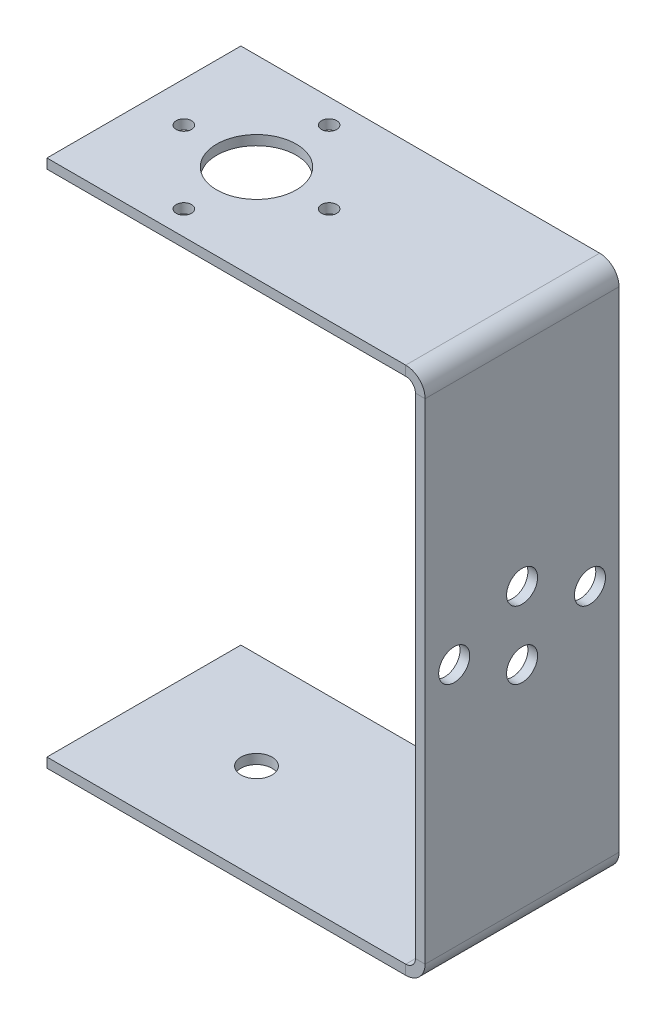
ISO-10303-21;
HEADER;
FILE_DESCRIPTION(('STEP AP214'),'2;1');
FILE_NAME('part.step','',(''),(''),'','','');
FILE_SCHEMA(('AUTOMOTIVE_DESIGN { 1 0 10303 214 1 1 1 1 }'));
ENDSEC;
DATA;
#1=APPLICATION_CONTEXT('core data for automotive mechanical design processes');
#2=APPLICATION_PROTOCOL_DEFINITION('international standard','automotive_design',2000,#1);
#3=PRODUCT_CONTEXT('',#1,'mechanical');
#4=PRODUCT('Part','Part','',(#3));
#5=PRODUCT_RELATED_PRODUCT_CATEGORY('part','',(#4));
#6=PRODUCT_DEFINITION_FORMATION('','',#4);
#7=PRODUCT_DEFINITION_CONTEXT('part definition',#1,'design');
#8=PRODUCT_DEFINITION('design','',#6,#7);
#9=PRODUCT_DEFINITION_SHAPE('','',#8);
#10=(LENGTH_UNIT() NAMED_UNIT(*) SI_UNIT(.MILLI.,.METRE.));
#11=(NAMED_UNIT(*) PLANE_ANGLE_UNIT() SI_UNIT($,.RADIAN.));
#12=(NAMED_UNIT(*) SI_UNIT($,.STERADIAN.) SOLID_ANGLE_UNIT());
#13=UNCERTAINTY_MEASURE_WITH_UNIT(LENGTH_MEASURE(1.E-05),#10,'distance_accuracy_value','');
#14=(GEOMETRIC_REPRESENTATION_CONTEXT(3) GLOBAL_UNCERTAINTY_ASSIGNED_CONTEXT((#13)) GLOBAL_UNIT_ASSIGNED_CONTEXT((#10,
#11,#12)) REPRESENTATION_CONTEXT('',''));
#15=CARTESIAN_POINT('',(0.,0.,0.));
#16=DIRECTION('',(0.,0.,1.));
#17=DIRECTION('',(1.,0.,0.));
#18=AXIS2_PLACEMENT_3D('',#15,#16,#17);
#19=CARTESIAN_POINT('',(-26.39,1.,-10.));
#20=DIRECTION('',(0.,-1.,0.));
#21=DIRECTION('',(0.,0.,-1.));
#22=AXIS2_PLACEMENT_3D('',#19,#20,#21);
#23=CYLINDRICAL_SURFACE('',#22,1.6);
#24=CARTESIAN_POINT('',(-26.39,1.,-10.));
#25=DIRECTION('',(0.,-1.,0.));
#26=DIRECTION('',(0.,0.,-1.));
#27=AXIS2_PLACEMENT_3D('',#24,#25,#26);
#28=CIRCLE('',#27,1.6);
#29=CARTESIAN_POINT('',(-26.39,1.,-11.6));
#30=VERTEX_POINT('',#29);
#31=EDGE_CURVE('E259',#30,#30,#28,.T.);
#32=ORIENTED_EDGE('',*,*,#31,.F.);
#33=EDGE_LOOP('',(#32));
#34=FACE_BOUND('',#33,.T.);
#35=CARTESIAN_POINT('',(-26.39,0.,-10.));
#36=DIRECTION('',(0.,-1.,0.));
#37=DIRECTION('',(0.,0.,-1.));
#38=AXIS2_PLACEMENT_3D('',#35,#36,#37);
#39=CIRCLE('',#38,1.6);
#40=CARTESIAN_POINT('',(-26.39,0.,-11.6));
#41=VERTEX_POINT('',#40);
#42=EDGE_CURVE('E187',#41,#41,#39,.T.);
#43=ORIENTED_EDGE('',*,*,#42,.T.);
#44=EDGE_LOOP('',(#43));
#45=FACE_BOUND('',#44,.T.);
#46=ADVANCED_FACE('F35',(#34,#45),#23,.F.);
#47=CARTESIAN_POINT('',(-38.,84.1189633792524,0.));
#48=DIRECTION('',(-1.,0.,0.));
#49=DIRECTION('',(0.,0.,-1.));
#50=AXIS2_PLACEMENT_3D('',#47,#48,#49);
#51=PLANE('',#50);
#52=DIRECTION('',(0.,0.,1.));
#53=VECTOR('',#52,1.);
#54=CARTESIAN_POINT('',(-38.,0.,0.));
#55=LINE('',#54,#53);
#56=CARTESIAN_POINT('',(-38.,0.,-20.));
#57=VERTEX_POINT('',#56);
#58=CARTESIAN_POINT('',(-38.,0.,0.));
#59=VERTEX_POINT('',#58);
#60=EDGE_CURVE('E69',#57,#59,#55,.T.);
#61=ORIENTED_EDGE('',*,*,#60,.T.);
#62=DIRECTION('',(0.,-1.,0.));
#63=VECTOR('',#62,1.);
#64=CARTESIAN_POINT('',(-38.,84.1189633792524,0.));
#65=LINE('',#64,#63);
#66=CARTESIAN_POINT('',(-38.,0.999999999999997,0.));
#67=VERTEX_POINT('',#66);
#68=EDGE_CURVE('E161',#67,#59,#65,.T.);
#69=ORIENTED_EDGE('',*,*,#68,.F.);
#70=DIRECTION('',(0.,0.,-1.));
#71=VECTOR('',#70,1.);
#72=CARTESIAN_POINT('',(-38.,1.,0.));
#73=LINE('',#72,#71);
#74=CARTESIAN_POINT('',(-38.,0.999999999999997,-20.));
#75=VERTEX_POINT('',#74);
#76=EDGE_CURVE('E54',#67,#75,#73,.T.);
#77=ORIENTED_EDGE('',*,*,#76,.T.);
#78=DIRECTION('',(0.,-1.,0.));
#79=VECTOR('',#78,1.);
#80=CARTESIAN_POINT('',(-38.,84.1189633792524,-20.));
#81=LINE('',#80,#79);
#82=EDGE_CURVE('E177',#75,#57,#81,.T.);
#83=ORIENTED_EDGE('',*,*,#82,.T.);
#84=EDGE_LOOP('',(#61,#69,#77,#83));
#85=FACE_BOUND('',#84,.T.);
#86=ADVANCED_FACE('F267',(#85),#51,.T.);
#87=CARTESIAN_POINT('',(-38.,84.1189633792524,-20.));
#88=DIRECTION('',(0.,0.,-1.));
#89=DIRECTION('',(1.,0.,0.));
#90=AXIS2_PLACEMENT_3D('',#87,#88,#89);
#91=PLANE('',#90);
#92=DIRECTION('',(-1.,0.,0.));
#93=VECTOR('',#92,1.);
#94=CARTESIAN_POINT('',(1.,0.,-20.));
#95=LINE('',#94,#93);
#96=CARTESIAN_POINT('',(-0.999999999999993,0.,-20.));
#97=VERTEX_POINT('',#96);
#98=EDGE_CURVE('E171',#97,#57,#95,.T.);
#99=ORIENTED_EDGE('',*,*,#98,.T.);
#100=ORIENTED_EDGE('',*,*,#82,.F.);
#101=DIRECTION('',(1.,0.,0.));
#102=VECTOR('',#101,1.);
#103=CARTESIAN_POINT('',(-38.,0.999999999999997,-20.));
#104=LINE('',#103,#102);
#105=CARTESIAN_POINT('',(-0.999999999999997,0.999999999999997,-20.));
#106=VERTEX_POINT('',#105);
#107=EDGE_CURVE('E176',#75,#106,#104,.T.);
#108=ORIENTED_EDGE('',*,*,#107,.T.);
#109=DIRECTION('',(0.,-1.,0.));
#110=VECTOR('',#109,1.);
#111=CARTESIAN_POINT('',(-1.,84.1189633792524,-20.));
#112=LINE('',#111,#110);
#113=EDGE_CURVE('E162',#106,#97,#112,.T.);
#114=ORIENTED_EDGE('',*,*,#113,.T.);
#115=EDGE_LOOP('',(#99,#100,#108,#114));
#116=FACE_BOUND('',#115,.T.);
#117=ADVANCED_FACE('F180',(#116),#91,.T.);
#118=CARTESIAN_POINT('',(1.,0.,0.));
#119=DIRECTION('',(0.,1.,0.));
#120=DIRECTION('',(0.,0.,1.));
#121=AXIS2_PLACEMENT_3D('',#118,#119,#120);
#122=PLANE('',#121);
#123=ORIENTED_EDGE('',*,*,#42,.F.);
#124=EDGE_LOOP('',(#123));
#125=FACE_BOUND('',#124,.T.);
#126=ORIENTED_EDGE('',*,*,#98,.F.);
#127=DIRECTION('',(0.,0.,1.));
#128=VECTOR('',#127,1.);
#129=CARTESIAN_POINT('',(-1.,0.,-20.));
#130=LINE('',#129,#128);
#131=CARTESIAN_POINT('',(-1.,0.,0.));
#132=VERTEX_POINT('',#131);
#133=EDGE_CURVE('E153',#97,#132,#130,.T.);
#134=ORIENTED_EDGE('',*,*,#133,.T.);
#135=DIRECTION('',(1.,0.,0.));
#136=VECTOR('',#135,1.);
#137=CARTESIAN_POINT('',(-38.,0.,0.));
#138=LINE('',#137,#136);
#139=EDGE_CURVE('E74',#59,#132,#138,.T.);
#140=ORIENTED_EDGE('',*,*,#139,.F.);
#141=ORIENTED_EDGE('',*,*,#60,.F.);
#142=EDGE_LOOP('',(#126,#134,#140,#141));
#143=FACE_BOUND('',#142,.T.);
#144=ADVANCED_FACE('F172',(#125,#143),#122,.F.);
#145=CARTESIAN_POINT('',(-38.,84.1189633792524,0.));
#146=DIRECTION('',(0.,0.,-1.));
#147=DIRECTION('',(1.,0.,0.));
#148=AXIS2_PLACEMENT_3D('',#145,#146,#147);
#149=PLANE('',#148);
#150=ORIENTED_EDGE('',*,*,#68,.T.);
#151=ORIENTED_EDGE('',*,*,#139,.T.);
#152=DIRECTION('',(0.,-1.,0.));
#153=VECTOR('',#152,1.);
#154=CARTESIAN_POINT('',(-1.,84.1189633792524,0.));
#155=LINE('',#154,#153);
#156=CARTESIAN_POINT('',(-0.999999999999998,1.,0.));
#157=VERTEX_POINT('',#156);
#158=EDGE_CURVE('E39',#157,#132,#155,.T.);
#159=ORIENTED_EDGE('',*,*,#158,.F.);
#160=DIRECTION('',(1.,0.,0.));
#161=VECTOR('',#160,1.);
#162=CARTESIAN_POINT('',(-38.,1.,0.));
#163=LINE('',#162,#161);
#164=EDGE_CURVE('E45',#67,#157,#163,.T.);
#165=ORIENTED_EDGE('',*,*,#164,.F.);
#166=EDGE_LOOP('',(#150,#151,#159,#165));
#167=FACE_BOUND('',#166,.T.);
#168=ADVANCED_FACE('F265',(#167),#149,.F.);
#169=CARTESIAN_POINT('',(-38.,1.,0.));
#170=DIRECTION('',(0.,-1.,0.));
#171=DIRECTION('',(0.,0.,-1.));
#172=AXIS2_PLACEMENT_3D('',#169,#170,#171);
#173=PLANE('',#172);
#174=ORIENTED_EDGE('',*,*,#31,.T.);
#175=EDGE_LOOP('',(#174));
#176=FACE_BOUND('',#175,.T.);
#177=ORIENTED_EDGE('',*,*,#164,.T.);
#178=DIRECTION('',(0.,0.,-1.));
#179=VECTOR('',#178,1.);
#180=CARTESIAN_POINT('',(-1.,0.999999999999997,-20.));
#181=LINE('',#180,#179);
#182=EDGE_CURVE('E11',#157,#106,#181,.T.);
#183=ORIENTED_EDGE('',*,*,#182,.T.);
#184=ORIENTED_EDGE('',*,*,#107,.F.);
#185=ORIENTED_EDGE('',*,*,#76,.F.);
#186=EDGE_LOOP('',(#177,#183,#184,#185));
#187=FACE_BOUND('',#186,.T.);
#188=ADVANCED_FACE('F37',(#176,#187),#173,.F.);
#189=CARTESIAN_POINT('',(-26.39,53.5,-10.));
#190=DIRECTION('',(0.,1.,0.));
#191=DIRECTION('',(0.,0.,1.));
#192=AXIS2_PLACEMENT_3D('',#189,#190,#191);
#193=CYLINDRICAL_SURFACE('',#192,4.1);
#194=CARTESIAN_POINT('',(-26.39,53.5,-10.));
#195=DIRECTION('',(0.,1.,0.));
#196=DIRECTION('',(0.,0.,1.));
#197=AXIS2_PLACEMENT_3D('',#194,#195,#196);
#198=CIRCLE('',#197,4.1);
#199=CARTESIAN_POINT('',(-26.39,53.5,-5.9));
#200=VERTEX_POINT('',#199);
#201=EDGE_CURVE('E198',#200,#200,#198,.T.);
#202=ORIENTED_EDGE('',*,*,#201,.F.);
#203=EDGE_LOOP('',(#202));
#204=FACE_BOUND('',#203,.T.);
#205=CARTESIAN_POINT('',(-26.39,54.5,-10.));
#206=DIRECTION('',(0.,1.,0.));
#207=DIRECTION('',(0.,0.,1.));
#208=AXIS2_PLACEMENT_3D('',#205,#206,#207);
#209=CIRCLE('',#208,4.1);
#210=CARTESIAN_POINT('',(-26.39,54.5,-5.9));
#211=VERTEX_POINT('',#210);
#212=EDGE_CURVE('E252',#211,#211,#209,.T.);
#213=ORIENTED_EDGE('',*,*,#212,.T.);
#214=EDGE_LOOP('',(#213));
#215=FACE_BOUND('',#214,.T.);
#216=ADVANCED_FACE('F287',(#204,#215),#193,.F.);
#217=CARTESIAN_POINT('',(-33.88,53.5,-10.));
#218=DIRECTION('',(0.,1.,0.));
#219=DIRECTION('',(0.,0.,1.));
#220=AXIS2_PLACEMENT_3D('',#217,#218,#219);
#221=CYLINDRICAL_SURFACE('',#220,0.789999999999999);
#222=CARTESIAN_POINT('',(-33.88,53.5,-10.));
#223=DIRECTION('',(0.,1.,0.));
#224=DIRECTION('',(0.,0.,1.));
#225=AXIS2_PLACEMENT_3D('',#222,#223,#224);
#226=CIRCLE('',#225,0.789999999999999);
#227=CARTESIAN_POINT('',(-33.88,53.5,-9.21));
#228=VERTEX_POINT('',#227);
#229=EDGE_CURVE('E208',#228,#228,#226,.T.);
#230=ORIENTED_EDGE('',*,*,#229,.F.);
#231=EDGE_LOOP('',(#230));
#232=FACE_BOUND('',#231,.T.);
#233=CARTESIAN_POINT('',(-33.88,54.5,-10.));
#234=DIRECTION('',(0.,1.,0.));
#235=DIRECTION('',(0.,0.,1.));
#236=AXIS2_PLACEMENT_3D('',#233,#234,#235);
#237=CIRCLE('',#236,0.789999999999999);
#238=CARTESIAN_POINT('',(-33.88,54.5,-9.21));
#239=VERTEX_POINT('',#238);
#240=EDGE_CURVE('E249',#239,#239,#237,.T.);
#241=ORIENTED_EDGE('',*,*,#240,.T.);
#242=EDGE_LOOP('',(#241));
#243=FACE_BOUND('',#242,.T.);
#244=ADVANCED_FACE('F292',(#232,#243),#221,.F.);
#245=CARTESIAN_POINT('',(-18.9,53.5,-10.));
#246=DIRECTION('',(0.,1.,0.));
#247=DIRECTION('',(0.,0.,1.));
#248=AXIS2_PLACEMENT_3D('',#245,#246,#247);
#249=CYLINDRICAL_SURFACE('',#248,0.790000000000002);
#250=CARTESIAN_POINT('',(-18.9,53.5,-10.));
#251=DIRECTION('',(0.,1.,0.));
#252=DIRECTION('',(0.,0.,1.));
#253=AXIS2_PLACEMENT_3D('',#250,#251,#252);
#254=CIRCLE('',#253,0.790000000000002);
#255=CARTESIAN_POINT('',(-18.9,53.5,-9.21));
#256=VERTEX_POINT('',#255);
#257=EDGE_CURVE('E211',#256,#256,#254,.T.);
#258=ORIENTED_EDGE('',*,*,#257,.F.);
#259=EDGE_LOOP('',(#258));
#260=FACE_BOUND('',#259,.T.);
#261=CARTESIAN_POINT('',(-18.9,54.5,-10.));
#262=DIRECTION('',(0.,1.,0.));
#263=DIRECTION('',(0.,0.,1.));
#264=AXIS2_PLACEMENT_3D('',#261,#262,#263);
#265=CIRCLE('',#264,0.790000000000002);
#266=CARTESIAN_POINT('',(-18.9,54.5,-9.21));
#267=VERTEX_POINT('',#266);
#268=EDGE_CURVE('E246',#267,#267,#265,.T.);
#269=ORIENTED_EDGE('',*,*,#268,.T.);
#270=EDGE_LOOP('',(#269));
#271=FACE_BOUND('',#270,.T.);
#272=ADVANCED_FACE('F419',(#260,#271),#249,.F.);
#273=CARTESIAN_POINT('',(-26.39,53.5,-2.51));
#274=DIRECTION('',(0.,1.,0.));
#275=DIRECTION('',(0.,0.,1.));
#276=AXIS2_PLACEMENT_3D('',#273,#274,#275);
#277=CYLINDRICAL_SURFACE('',#276,0.789999999999999);
#278=CARTESIAN_POINT('',(-26.39,53.5,-2.51));
#279=DIRECTION('',(0.,1.,0.));
#280=DIRECTION('',(0.,0.,1.));
#281=AXIS2_PLACEMENT_3D('',#278,#279,#280);
#282=CIRCLE('',#281,0.789999999999999);
#283=CARTESIAN_POINT('',(-26.39,53.5,-1.72));
#284=VERTEX_POINT('',#283);
#285=EDGE_CURVE('E214',#284,#284,#282,.T.);
#286=ORIENTED_EDGE('',*,*,#285,.F.);
#287=EDGE_LOOP('',(#286));
#288=FACE_BOUND('',#287,.T.);
#289=CARTESIAN_POINT('',(-26.39,54.5,-2.51));
#290=DIRECTION('',(0.,1.,0.));
#291=DIRECTION('',(0.,0.,1.));
#292=AXIS2_PLACEMENT_3D('',#289,#290,#291);
#293=CIRCLE('',#292,0.789999999999999);
#294=CARTESIAN_POINT('',(-26.39,54.5,-1.72));
#295=VERTEX_POINT('',#294);
#296=EDGE_CURVE('E243',#295,#295,#293,.T.);
#297=ORIENTED_EDGE('',*,*,#296,.T.);
#298=EDGE_LOOP('',(#297));
#299=FACE_BOUND('',#298,.T.);
#300=ADVANCED_FACE('F423',(#288,#299),#277,.F.);
#301=CARTESIAN_POINT('',(-26.39,53.5,-17.49));
#302=DIRECTION('',(0.,1.,0.));
#303=DIRECTION('',(0.,0.,1.));
#304=AXIS2_PLACEMENT_3D('',#301,#302,#303);
#305=CYLINDRICAL_SURFACE('',#304,0.789999999999999);
#306=CARTESIAN_POINT('',(-26.39,53.5,-17.49));
#307=DIRECTION('',(0.,1.,0.));
#308=DIRECTION('',(0.,0.,1.));
#309=AXIS2_PLACEMENT_3D('',#306,#307,#308);
#310=CIRCLE('',#309,0.789999999999999);
#311=CARTESIAN_POINT('',(-26.39,53.5,-16.7));
#312=VERTEX_POINT('',#311);
#313=EDGE_CURVE('E217',#312,#312,#310,.T.);
#314=ORIENTED_EDGE('',*,*,#313,.F.);
#315=EDGE_LOOP('',(#314));
#316=FACE_BOUND('',#315,.T.);
#317=CARTESIAN_POINT('',(-26.39,54.5,-17.49));
#318=DIRECTION('',(0.,1.,0.));
#319=DIRECTION('',(0.,0.,1.));
#320=AXIS2_PLACEMENT_3D('',#317,#318,#319);
#321=CIRCLE('',#320,0.789999999999999);
#322=CARTESIAN_POINT('',(-26.39,54.5,-16.7));
#323=VERTEX_POINT('',#322);
#324=EDGE_CURVE('E240',#323,#323,#321,.T.);
#325=ORIENTED_EDGE('',*,*,#324,.T.);
#326=EDGE_LOOP('',(#325));
#327=FACE_BOUND('',#326,.T.);
#328=ADVANCED_FACE('F427',(#316,#327),#305,.F.);
#329=CARTESIAN_POINT('',(-38.,-29.6189633792523,-20.));
#330=DIRECTION('',(-1.,0.,0.));
#331=DIRECTION('',(0.,-1.,0.));
#332=AXIS2_PLACEMENT_3D('',#329,#330,#331);
#333=PLANE('',#332);
#334=DIRECTION('',(0.,0.,-1.));
#335=VECTOR('',#334,1.);
#336=CARTESIAN_POINT('',(-38.,54.5,-20.));
#337=LINE('',#336,#335);
#338=CARTESIAN_POINT('',(-38.,54.5,0.));
#339=VERTEX_POINT('',#338);
#340=CARTESIAN_POINT('',(-38.,54.5,-20.));
#341=VERTEX_POINT('',#340);
#342=EDGE_CURVE('E97',#339,#341,#337,.T.);
#343=ORIENTED_EDGE('',*,*,#342,.T.);
#344=DIRECTION('',(0.,1.,0.));
#345=VECTOR('',#344,1.);
#346=CARTESIAN_POINT('',(-38.,-29.6189633792523,-20.));
#347=LINE('',#346,#345);
#348=CARTESIAN_POINT('',(-38.,53.5,-20.));
#349=VERTEX_POINT('',#348);
#350=EDGE_CURVE('E221',#349,#341,#347,.T.);
#351=ORIENTED_EDGE('',*,*,#350,.F.);
#352=DIRECTION('',(0.,0.,1.));
#353=VECTOR('',#352,1.);
#354=CARTESIAN_POINT('',(-38.,53.5,-20.));
#355=LINE('',#354,#353);
#356=CARTESIAN_POINT('',(-38.,53.5,0.));
#357=VERTEX_POINT('',#356);
#358=EDGE_CURVE('E82',#349,#357,#355,.T.);
#359=ORIENTED_EDGE('',*,*,#358,.T.);
#360=DIRECTION('',(0.,1.,0.));
#361=VECTOR('',#360,1.);
#362=CARTESIAN_POINT('',(-38.,-29.6189633792523,0.));
#363=LINE('',#362,#361);
#364=EDGE_CURVE('E235',#357,#339,#363,.T.);
#365=ORIENTED_EDGE('',*,*,#364,.T.);
#366=EDGE_LOOP('',(#343,#351,#359,#365));
#367=FACE_BOUND('',#366,.T.);
#368=ADVANCED_FACE('F431',(#367),#333,.T.);
#369=CARTESIAN_POINT('',(-38.,-29.6189633792523,0.));
#370=DIRECTION('',(0.,0.,1.));
#371=DIRECTION('',(0.,1.,0.));
#372=AXIS2_PLACEMENT_3D('',#369,#370,#371);
#373=PLANE('',#372);
#374=DIRECTION('',(-1.,0.,0.));
#375=VECTOR('',#374,1.);
#376=CARTESIAN_POINT('',(1.,54.5,0.));
#377=LINE('',#376,#375);
#378=CARTESIAN_POINT('',(-0.999999999999997,54.5,0.));
#379=VERTEX_POINT('',#378);
#380=EDGE_CURVE('E231',#379,#339,#377,.T.);
#381=ORIENTED_EDGE('',*,*,#380,.T.);
#382=ORIENTED_EDGE('',*,*,#364,.F.);
#383=DIRECTION('',(1.,0.,0.));
#384=VECTOR('',#383,1.);
#385=CARTESIAN_POINT('',(-38.,53.5,0.));
#386=LINE('',#385,#384);
#387=CARTESIAN_POINT('',(-0.999999999999999,53.5,0.));
#388=VERTEX_POINT('',#387);
#389=EDGE_CURVE('E229',#357,#388,#386,.T.);
#390=ORIENTED_EDGE('',*,*,#389,.T.);
#391=DIRECTION('',(0.,1.,0.));
#392=VECTOR('',#391,1.);
#393=CARTESIAN_POINT('',(-1.00000000000001,-29.6189633792523,0.));
#394=LINE('',#393,#392);
#395=EDGE_CURVE('E226',#388,#379,#394,.T.);
#396=ORIENTED_EDGE('',*,*,#395,.T.);
#397=EDGE_LOOP('',(#381,#382,#390,#396));
#398=FACE_BOUND('',#397,.T.);
#399=ADVANCED_FACE('F434',(#398),#373,.T.);
#400=CARTESIAN_POINT('',(1.,54.5,0.));
#401=DIRECTION('',(0.,-1.,0.));
#402=DIRECTION('',(0.,0.,-1.));
#403=AXIS2_PLACEMENT_3D('',#400,#401,#402);
#404=PLANE('',#403);
#405=ORIENTED_EDGE('',*,*,#324,.F.);
#406=EDGE_LOOP('',(#405));
#407=FACE_BOUND('',#406,.T.);
#408=ORIENTED_EDGE('',*,*,#296,.F.);
#409=EDGE_LOOP('',(#408));
#410=FACE_BOUND('',#409,.T.);
#411=ORIENTED_EDGE('',*,*,#268,.F.);
#412=EDGE_LOOP('',(#411));
#413=FACE_BOUND('',#412,.T.);
#414=ORIENTED_EDGE('',*,*,#240,.F.);
#415=EDGE_LOOP('',(#414));
#416=FACE_BOUND('',#415,.T.);
#417=ORIENTED_EDGE('',*,*,#212,.F.);
#418=EDGE_LOOP('',(#417));
#419=FACE_BOUND('',#418,.T.);
#420=ORIENTED_EDGE('',*,*,#380,.F.);
#421=DIRECTION('',(0.,0.,-1.));
#422=VECTOR('',#421,1.);
#423=CARTESIAN_POINT('',(-1.00000000000001,54.5,0.));
#424=LINE('',#423,#422);
#425=CARTESIAN_POINT('',(-1.,54.5,-20.));
#426=VERTEX_POINT('',#425);
#427=EDGE_CURVE('E224',#379,#426,#424,.T.);
#428=ORIENTED_EDGE('',*,*,#427,.T.);
#429=DIRECTION('',(1.,0.,0.));
#430=VECTOR('',#429,1.);
#431=CARTESIAN_POINT('',(-38.,54.5,-20.));
#432=LINE('',#431,#430);
#433=EDGE_CURVE('E101',#341,#426,#432,.T.);
#434=ORIENTED_EDGE('',*,*,#433,.F.);
#435=ORIENTED_EDGE('',*,*,#342,.F.);
#436=EDGE_LOOP('',(#420,#428,#434,#435));
#437=FACE_BOUND('',#436,.T.);
#438=ADVANCED_FACE('F376',(#407,#410,#413,#416,#419,#437),#404,.F.);
#439=CARTESIAN_POINT('',(-38.,-29.6189633792523,-20.));
#440=DIRECTION('',(0.,0.,1.));
#441=DIRECTION('',(0.,1.,0.));
#442=AXIS2_PLACEMENT_3D('',#439,#440,#441);
#443=PLANE('',#442);
#444=ORIENTED_EDGE('',*,*,#350,.T.);
#445=ORIENTED_EDGE('',*,*,#433,.T.);
#446=DIRECTION('',(0.,1.,0.));
#447=VECTOR('',#446,1.);
#448=CARTESIAN_POINT('',(-1.00000000000001,-29.6189633792523,-20.));
#449=LINE('',#448,#447);
#450=CARTESIAN_POINT('',(-0.999999999999999,53.5,-20.));
#451=VERTEX_POINT('',#450);
#452=EDGE_CURVE('E255',#451,#426,#449,.T.);
#453=ORIENTED_EDGE('',*,*,#452,.F.);
#454=DIRECTION('',(1.,0.,0.));
#455=VECTOR('',#454,1.);
#456=CARTESIAN_POINT('',(-38.,53.5,-20.));
#457=LINE('',#456,#455);
#458=EDGE_CURVE('E195',#349,#451,#457,.T.);
#459=ORIENTED_EDGE('',*,*,#458,.F.);
#460=EDGE_LOOP('',(#444,#445,#453,#459));
#461=FACE_BOUND('',#460,.T.);
#462=ADVANCED_FACE('F374',(#461),#443,.F.);
#463=CARTESIAN_POINT('',(-38.,53.5,-20.));
#464=DIRECTION('',(0.,1.,0.));
#465=DIRECTION('',(0.,0.,1.));
#466=AXIS2_PLACEMENT_3D('',#463,#464,#465);
#467=PLANE('',#466);
#468=ORIENTED_EDGE('',*,*,#313,.T.);
#469=EDGE_LOOP('',(#468));
#470=FACE_BOUND('',#469,.T.);
#471=ORIENTED_EDGE('',*,*,#285,.T.);
#472=EDGE_LOOP('',(#471));
#473=FACE_BOUND('',#472,.T.);
#474=ORIENTED_EDGE('',*,*,#257,.T.);
#475=EDGE_LOOP('',(#474));
#476=FACE_BOUND('',#475,.T.);
#477=ORIENTED_EDGE('',*,*,#229,.T.);
#478=EDGE_LOOP('',(#477));
#479=FACE_BOUND('',#478,.T.);
#480=ORIENTED_EDGE('',*,*,#201,.T.);
#481=EDGE_LOOP('',(#480));
#482=FACE_BOUND('',#481,.T.);
#483=ORIENTED_EDGE('',*,*,#458,.T.);
#484=DIRECTION('',(0.,0.,1.));
#485=VECTOR('',#484,1.);
#486=CARTESIAN_POINT('',(-1.00000000000001,53.5,0.));
#487=LINE('',#486,#485);
#488=EDGE_CURVE('E191',#451,#388,#487,.T.);
#489=ORIENTED_EDGE('',*,*,#488,.T.);
#490=ORIENTED_EDGE('',*,*,#389,.F.);
#491=ORIENTED_EDGE('',*,*,#358,.F.);
#492=EDGE_LOOP('',(#483,#489,#490,#491));
#493=FACE_BOUND('',#492,.T.);
#494=ADVANCED_FACE('F395',(#470,#473,#476,#479,#482,#493),#467,.F.);
#495=CARTESIAN_POINT('',(1.,0.,0.));
#496=DIRECTION('',(-1.,0.,0.));
#497=DIRECTION('',(0.,0.,1.));
#498=AXIS2_PLACEMENT_3D('',#495,#496,#497);
#499=PLANE('',#498);
#500=CARTESIAN_POINT('',(1.,30.75,-10.));
#501=DIRECTION('',(1.,0.,0.));
#502=DIRECTION('',(0.,0.,-1.));
#503=AXIS2_PLACEMENT_3D('',#500,#501,#502);
#504=CIRCLE('',#503,1.6);
#505=CARTESIAN_POINT('',(1.,30.75,-11.6));
#506=VERTEX_POINT('',#505);
#507=EDGE_CURVE('E339',#506,#506,#504,.T.);
#508=ORIENTED_EDGE('',*,*,#507,.F.);
#509=EDGE_LOOP('',(#508));
#510=FACE_BOUND('',#509,.T.);
#511=CARTESIAN_POINT('',(1.,23.75,-10.));
#512=DIRECTION('',(1.,0.,0.));
#513=DIRECTION('',(0.,0.,-1.));
#514=AXIS2_PLACEMENT_3D('',#511,#512,#513);
#515=CIRCLE('',#514,1.6);
#516=CARTESIAN_POINT('',(1.,23.75,-11.6));
#517=VERTEX_POINT('',#516);
#518=EDGE_CURVE('E780',#517,#517,#515,.T.);
#519=ORIENTED_EDGE('',*,*,#518,.F.);
#520=EDGE_LOOP('',(#519));
#521=FACE_BOUND('',#520,.T.);
#522=CARTESIAN_POINT('',(1.,27.25,-3.00000000000002));
#523=DIRECTION('',(1.,0.,0.));
#524=DIRECTION('',(0.,0.,-1.));
#525=AXIS2_PLACEMENT_3D('',#522,#523,#524);
#526=CIRCLE('',#525,1.6);
#527=CARTESIAN_POINT('',(1.,27.25,-4.60000000000002));
#528=VERTEX_POINT('',#527);
#529=EDGE_CURVE('E777',#528,#528,#526,.T.);
#530=ORIENTED_EDGE('',*,*,#529,.F.);
#531=EDGE_LOOP('',(#530));
#532=FACE_BOUND('',#531,.T.);
#533=CARTESIAN_POINT('',(1.,27.25,-17.));
#534=DIRECTION('',(1.,0.,0.));
#535=DIRECTION('',(0.,0.,-1.));
#536=AXIS2_PLACEMENT_3D('',#533,#534,#535);
#537=CIRCLE('',#536,1.6);
#538=CARTESIAN_POINT('',(1.,27.25,-18.6));
#539=VERTEX_POINT('',#538);
#540=EDGE_CURVE('E779',#539,#539,#537,.T.);
#541=ORIENTED_EDGE('',*,*,#540,.F.);
#542=EDGE_LOOP('',(#541));
#543=FACE_BOUND('',#542,.T.);
#544=DIRECTION('',(0.,0.,1.));
#545=VECTOR('',#544,1.);
#546=CARTESIAN_POINT('',(1.,2.,-20.));
#547=LINE('',#546,#545);
#548=CARTESIAN_POINT('',(1.,2.,-20.));
#549=VERTEX_POINT('',#548);
#550=CARTESIAN_POINT('',(1.,2.,0.));
#551=VERTEX_POINT('',#550);
#552=EDGE_CURVE('E343',#549,#551,#547,.T.);
#553=ORIENTED_EDGE('',*,*,#552,.F.);
#554=DIRECTION('',(0.,1.,0.));
#555=VECTOR('',#554,1.);
#556=CARTESIAN_POINT('',(1.,0.,-20.));
#557=LINE('',#556,#555);
#558=CARTESIAN_POINT('',(1.,52.5,-20.));
#559=VERTEX_POINT('',#558);
#560=EDGE_CURVE('E336',#549,#559,#557,.T.);
#561=ORIENTED_EDGE('',*,*,#560,.T.);
#562=DIRECTION('',(0.,0.,-1.));
#563=VECTOR('',#562,1.);
#564=CARTESIAN_POINT('',(1.,52.5,0.));
#565=LINE('',#564,#563);
#566=CARTESIAN_POINT('',(1.,52.5,0.));
#567=VERTEX_POINT('',#566);
#568=EDGE_CURVE('E201',#567,#559,#565,.T.);
#569=ORIENTED_EDGE('',*,*,#568,.F.);
#570=DIRECTION('',(0.,-1.,0.));
#571=VECTOR('',#570,1.);
#572=CARTESIAN_POINT('',(1.,0.,0.));
#573=LINE('',#572,#571);
#574=EDGE_CURVE('E368',#567,#551,#573,.T.);
#575=ORIENTED_EDGE('',*,*,#574,.T.);
#576=EDGE_LOOP('',(#553,#561,#569,#575));
#577=FACE_BOUND('',#576,.T.);
#578=ADVANCED_FACE('F366',(#510,#521,#532,#543,#577),#499,.F.);
#579=CARTESIAN_POINT('',(0.,0.,0.));
#580=DIRECTION('',(-1.,0.,0.));
#581=DIRECTION('',(0.,0.,1.));
#582=AXIS2_PLACEMENT_3D('',#579,#580,#581);
#583=PLANE('',#582);
#584=CARTESIAN_POINT('',(0.,30.75,-10.));
#585=DIRECTION('',(-1.,0.,0.));
#586=DIRECTION('',(0.,0.,1.));
#587=AXIS2_PLACEMENT_3D('',#584,#585,#586);
#588=CIRCLE('',#587,1.6);
#589=CARTESIAN_POINT('',(0.,30.75,-8.4));
#590=VERTEX_POINT('',#589);
#591=EDGE_CURVE('E311',#590,#590,#588,.F.);
#592=ORIENTED_EDGE('',*,*,#591,.T.);
#593=EDGE_LOOP('',(#592));
#594=FACE_BOUND('',#593,.T.);
#595=CARTESIAN_POINT('',(0.,23.75,-10.));
#596=DIRECTION('',(-1.,0.,0.));
#597=DIRECTION('',(0.,0.,1.));
#598=AXIS2_PLACEMENT_3D('',#595,#596,#597);
#599=CIRCLE('',#598,1.6);
#600=CARTESIAN_POINT('',(0.,23.75,-8.40000000000001));
#601=VERTEX_POINT('',#600);
#602=EDGE_CURVE('E317',#601,#601,#599,.F.);
#603=ORIENTED_EDGE('',*,*,#602,.T.);
#604=EDGE_LOOP('',(#603));
#605=FACE_BOUND('',#604,.T.);
#606=CARTESIAN_POINT('',(0.,27.25,-3.00000000000002));
#607=DIRECTION('',(-1.,0.,0.));
#608=DIRECTION('',(0.,0.,1.));
#609=AXIS2_PLACEMENT_3D('',#606,#607,#608);
#610=CIRCLE('',#609,1.6);
#611=CARTESIAN_POINT('',(0.,27.25,-1.40000000000002));
#612=VERTEX_POINT('',#611);
#613=EDGE_CURVE('E320',#612,#612,#610,.F.);
#614=ORIENTED_EDGE('',*,*,#613,.T.);
#615=EDGE_LOOP('',(#614));
#616=FACE_BOUND('',#615,.T.);
#617=CARTESIAN_POINT('',(0.,27.25,-17.));
#618=DIRECTION('',(-1.,0.,0.));
#619=DIRECTION('',(0.,0.,1.));
#620=AXIS2_PLACEMENT_3D('',#617,#618,#619);
#621=CIRCLE('',#620,1.6);
#622=CARTESIAN_POINT('',(0.,27.25,-15.4));
#623=VERTEX_POINT('',#622);
#624=EDGE_CURVE('E323',#623,#623,#621,.F.);
#625=ORIENTED_EDGE('',*,*,#624,.T.);
#626=EDGE_LOOP('',(#625));
#627=FACE_BOUND('',#626,.T.);
#628=DIRECTION('',(0.,1.,0.));
#629=VECTOR('',#628,1.);
#630=CARTESIAN_POINT('',(0.,0.,-20.));
#631=LINE('',#630,#629);
#632=CARTESIAN_POINT('',(0.,2.,-20.));
#633=VERTEX_POINT('',#632);
#634=CARTESIAN_POINT('',(0.,52.5,-20.));
#635=VERTEX_POINT('',#634);
#636=EDGE_CURVE('E326',#633,#635,#631,.T.);
#637=ORIENTED_EDGE('',*,*,#636,.F.);
#638=DIRECTION('',(0.,0.,1.));
#639=VECTOR('',#638,1.);
#640=CARTESIAN_POINT('',(0.,2.,-20.));
#641=LINE('',#640,#639);
#642=CARTESIAN_POINT('',(0.,2.,0.));
#643=VERTEX_POINT('',#642);
#644=EDGE_CURVE('E340',#633,#643,#641,.T.);
#645=ORIENTED_EDGE('',*,*,#644,.T.);
#646=DIRECTION('',(0.,-1.,0.));
#647=VECTOR('',#646,1.);
#648=CARTESIAN_POINT('',(0.,0.,0.));
#649=LINE('',#648,#647);
#650=CARTESIAN_POINT('',(0.,52.5,0.));
#651=VERTEX_POINT('',#650);
#652=EDGE_CURVE('E335',#651,#643,#649,.T.);
#653=ORIENTED_EDGE('',*,*,#652,.F.);
#654=DIRECTION('',(0.,0.,-1.));
#655=VECTOR('',#654,1.);
#656=CARTESIAN_POINT('',(0.,52.5,0.));
#657=LINE('',#656,#655);
#658=EDGE_CURVE('E351',#651,#635,#657,.T.);
#659=ORIENTED_EDGE('',*,*,#658,.T.);
#660=EDGE_LOOP('',(#637,#645,#653,#659));
#661=FACE_BOUND('',#660,.T.);
#662=ADVANCED_FACE('F383',(#594,#605,#616,#627,#661),#583,.T.);
#663=CARTESIAN_POINT('',(-38.001025,27.25,-17.));
#664=DIRECTION('',(1.,0.,0.));
#665=DIRECTION('',(0.,0.,-1.));
#666=AXIS2_PLACEMENT_3D('',#663,#664,#665);
#667=CYLINDRICAL_SURFACE('',#666,1.6);
#668=ORIENTED_EDGE('',*,*,#624,.F.);
#669=EDGE_LOOP('',(#668));
#670=FACE_BOUND('',#669,.T.);
#671=ORIENTED_EDGE('',*,*,#540,.T.);
#672=EDGE_LOOP('',(#671));
#673=FACE_BOUND('',#672,.T.);
#674=ADVANCED_FACE('F385',(#670,#673),#667,.F.);
#675=CARTESIAN_POINT('',(-38.001025,27.25,-3.00000000000002));
#676=DIRECTION('',(1.,0.,0.));
#677=DIRECTION('',(0.,0.,-1.));
#678=AXIS2_PLACEMENT_3D('',#675,#676,#677);
#679=CYLINDRICAL_SURFACE('',#678,1.6);
#680=ORIENTED_EDGE('',*,*,#613,.F.);
#681=EDGE_LOOP('',(#680));
#682=FACE_BOUND('',#681,.T.);
#683=ORIENTED_EDGE('',*,*,#529,.T.);
#684=EDGE_LOOP('',(#683));
#685=FACE_BOUND('',#684,.T.);
#686=ADVANCED_FACE('F392',(#682,#685),#679,.F.);
#687=CARTESIAN_POINT('',(-38.001025,23.75,-10.));
#688=DIRECTION('',(1.,0.,0.));
#689=DIRECTION('',(0.,0.,-1.));
#690=AXIS2_PLACEMENT_3D('',#687,#688,#689);
#691=CYLINDRICAL_SURFACE('',#690,1.6);
#692=ORIENTED_EDGE('',*,*,#602,.F.);
#693=EDGE_LOOP('',(#692));
#694=FACE_BOUND('',#693,.T.);
#695=ORIENTED_EDGE('',*,*,#518,.T.);
#696=EDGE_LOOP('',(#695));
#697=FACE_BOUND('',#696,.T.);
#698=ADVANCED_FACE('F404',(#694,#697),#691,.F.);
#699=CARTESIAN_POINT('',(-38.001025,30.75,-10.));
#700=DIRECTION('',(1.,0.,0.));
#701=DIRECTION('',(0.,0.,-1.));
#702=AXIS2_PLACEMENT_3D('',#699,#700,#701);
#703=CYLINDRICAL_SURFACE('',#702,1.6);
#704=ORIENTED_EDGE('',*,*,#591,.F.);
#705=EDGE_LOOP('',(#704));
#706=FACE_BOUND('',#705,.T.);
#707=ORIENTED_EDGE('',*,*,#507,.T.);
#708=EDGE_LOOP('',(#707));
#709=FACE_BOUND('',#708,.T.);
#710=ADVANCED_FACE('F402',(#706,#709),#703,.F.);
#711=CARTESIAN_POINT('',(-107.632407687577,0.,-20.));
#712=DIRECTION('',(0.,0.,-1.));
#713=DIRECTION('',(-1.,0.,0.));
#714=AXIS2_PLACEMENT_3D('',#711,#712,#713);
#715=PLANE('',#714);
#716=ORIENTED_EDGE('',*,*,#560,.F.);
#717=DIRECTION('',(1.,0.,0.));
#718=VECTOR('',#717,1.);
#719=CARTESIAN_POINT('',(-107.632407687577,2.,-20.));
#720=LINE('',#719,#718);
#721=EDGE_CURVE('E169',#633,#549,#720,.T.);
#722=ORIENTED_EDGE('',*,*,#721,.F.);
#723=ORIENTED_EDGE('',*,*,#636,.T.);
#724=DIRECTION('',(1.,0.,0.));
#725=VECTOR('',#724,1.);
#726=CARTESIAN_POINT('',(-107.632407687577,52.5,-20.));
#727=LINE('',#726,#725);
#728=EDGE_CURVE('E345',#635,#559,#727,.T.);
#729=ORIENTED_EDGE('',*,*,#728,.T.);
#730=EDGE_LOOP('',(#716,#722,#723,#729));
#731=FACE_BOUND('',#730,.T.);
#732=ADVANCED_FACE('F369',(#731),#715,.T.);
#733=CARTESIAN_POINT('',(-107.632407687577,0.,0.));
#734=DIRECTION('',(0.,0.,1.));
#735=DIRECTION('',(1.,0.,0.));
#736=AXIS2_PLACEMENT_3D('',#733,#734,#735);
#737=PLANE('',#736);
#738=ORIENTED_EDGE('',*,*,#574,.F.);
#739=DIRECTION('',(1.,0.,0.));
#740=VECTOR('',#739,1.);
#741=CARTESIAN_POINT('',(-107.632407687577,52.5,0.));
#742=LINE('',#741,#740);
#743=EDGE_CURVE('E348',#651,#567,#742,.T.);
#744=ORIENTED_EDGE('',*,*,#743,.F.);
#745=ORIENTED_EDGE('',*,*,#652,.T.);
#746=DIRECTION('',(1.,0.,0.));
#747=VECTOR('',#746,1.);
#748=CARTESIAN_POINT('',(-107.632407687577,2.,0.));
#749=LINE('',#748,#747);
#750=EDGE_CURVE('E300',#643,#551,#749,.T.);
#751=ORIENTED_EDGE('',*,*,#750,.T.);
#752=EDGE_LOOP('',(#738,#744,#745,#751));
#753=FACE_BOUND('',#752,.T.);
#754=ADVANCED_FACE('F382',(#753),#737,.T.);
#755=CARTESIAN_POINT('',(-1.,52.5,-20.));
#756=DIRECTION('',(0.,0.,-1.));
#757=DIRECTION('',(-1.,0.,0.));
#758=AXIS2_PLACEMENT_3D('',#755,#756,#757);
#759=PLANE('',#758);
#760=ORIENTED_EDGE('',*,*,#728,.F.);
#761=CARTESIAN_POINT('',(-1.,52.5,-20.));
#762=DIRECTION('',(0.,0.,-1.));
#763=DIRECTION('',(-1.,0.,0.));
#764=AXIS2_PLACEMENT_3D('',#761,#762,#763);
#765=CIRCLE('',#764,1.);
#766=EDGE_CURVE('E116',#635,#451,#765,.F.);
#767=ORIENTED_EDGE('',*,*,#766,.T.);
#768=ORIENTED_EDGE('',*,*,#452,.T.);
#769=CARTESIAN_POINT('',(-1.,52.5,-20.));
#770=DIRECTION('',(0.,0.,-1.));
#771=DIRECTION('',(-1.,0.,0.));
#772=AXIS2_PLACEMENT_3D('',#769,#770,#771);
#773=CIRCLE('',#772,2.);
#774=EDGE_CURVE('E309',#559,#426,#773,.F.);
#775=ORIENTED_EDGE('',*,*,#774,.F.);
#776=EDGE_LOOP('',(#760,#767,#768,#775));
#777=FACE_BOUND('',#776,.T.);
#778=ADVANCED_FACE('F371',(#777),#759,.T.);
#779=CARTESIAN_POINT('',(-1.,52.5,0.));
#780=DIRECTION('',(0.,0.,1.));
#781=DIRECTION('',(1.,0.,0.));
#782=AXIS2_PLACEMENT_3D('',#779,#780,#781);
#783=PLANE('',#782);
#784=ORIENTED_EDGE('',*,*,#395,.F.);
#785=CARTESIAN_POINT('',(-1.,52.5,0.));
#786=DIRECTION('',(0.,0.,-1.));
#787=DIRECTION('',(-1.,0.,0.));
#788=AXIS2_PLACEMENT_3D('',#785,#786,#787);
#789=CIRCLE('',#788,1.);
#790=EDGE_CURVE('E312',#388,#651,#789,.T.);
#791=ORIENTED_EDGE('',*,*,#790,.T.);
#792=ORIENTED_EDGE('',*,*,#743,.T.);
#793=CARTESIAN_POINT('',(-1.,52.5,0.));
#794=DIRECTION('',(0.,0.,-1.));
#795=DIRECTION('',(-1.,0.,0.));
#796=AXIS2_PLACEMENT_3D('',#793,#794,#795);
#797=CIRCLE('',#796,2.);
#798=EDGE_CURVE('E306',#379,#567,#797,.T.);
#799=ORIENTED_EDGE('',*,*,#798,.F.);
#800=EDGE_LOOP('',(#784,#791,#792,#799));
#801=FACE_BOUND('',#800,.T.);
#802=ADVANCED_FACE('F378',(#801),#783,.T.);
#803=CARTESIAN_POINT('',(-1.,52.5,130.754890791963));
#804=DIRECTION('',(0.,0.,-1.));
#805=DIRECTION('',(-1.,0.,0.));
#806=AXIS2_PLACEMENT_3D('',#803,#804,#805);
#807=CYLINDRICAL_SURFACE('',#806,2.);
#808=ORIENTED_EDGE('',*,*,#798,.T.);
#809=ORIENTED_EDGE('',*,*,#568,.T.);
#810=ORIENTED_EDGE('',*,*,#774,.T.);
#811=ORIENTED_EDGE('',*,*,#427,.F.);
#812=EDGE_LOOP('',(#808,#809,#810,#811));
#813=FACE_BOUND('',#812,.T.);
#814=ADVANCED_FACE('F360',(#813),#807,.T.);
#815=CARTESIAN_POINT('',(-1.,52.5,130.754890791963));
#816=DIRECTION('',(0.,0.,-1.));
#817=DIRECTION('',(-1.,0.,0.));
#818=AXIS2_PLACEMENT_3D('',#815,#816,#817);
#819=CYLINDRICAL_SURFACE('',#818,1.);
#820=ORIENTED_EDGE('',*,*,#790,.F.);
#821=ORIENTED_EDGE('',*,*,#488,.F.);
#822=ORIENTED_EDGE('',*,*,#766,.F.);
#823=ORIENTED_EDGE('',*,*,#658,.F.);
#824=EDGE_LOOP('',(#820,#821,#822,#823));
#825=FACE_BOUND('',#824,.T.);
#826=ADVANCED_FACE('F519',(#825),#819,.F.);
#827=CARTESIAN_POINT('',(-1.,2.,0.));
#828=DIRECTION('',(0.,0.,1.));
#829=DIRECTION('',(0.,-1.,0.));
#830=AXIS2_PLACEMENT_3D('',#827,#828,#829);
#831=PLANE('',#830);
#832=ORIENTED_EDGE('',*,*,#750,.F.);
#833=CARTESIAN_POINT('',(-1.,2.,0.));
#834=DIRECTION('',(0.,0.,1.));
#835=DIRECTION('',(0.,-1.,0.));
#836=AXIS2_PLACEMENT_3D('',#833,#834,#835);
#837=CIRCLE('',#836,1.);
#838=EDGE_CURVE('E108',#643,#157,#837,.F.);
#839=ORIENTED_EDGE('',*,*,#838,.T.);
#840=ORIENTED_EDGE('',*,*,#158,.T.);
#841=CARTESIAN_POINT('',(-1.,2.,0.));
#842=DIRECTION('',(0.,0.,1.));
#843=DIRECTION('',(0.,-1.,0.));
#844=AXIS2_PLACEMENT_3D('',#841,#842,#843);
#845=CIRCLE('',#844,2.);
#846=EDGE_CURVE('E159',#551,#132,#845,.F.);
#847=ORIENTED_EDGE('',*,*,#846,.F.);
#848=EDGE_LOOP('',(#832,#839,#840,#847));
#849=FACE_BOUND('',#848,.T.);
#850=ADVANCED_FACE('F298',(#849),#831,.T.);
#851=CARTESIAN_POINT('',(-1.,2.,-20.));
#852=DIRECTION('',(0.,0.,-1.));
#853=DIRECTION('',(-1.,0.,0.));
#854=AXIS2_PLACEMENT_3D('',#851,#852,#853);
#855=PLANE('',#854);
#856=ORIENTED_EDGE('',*,*,#113,.F.);
#857=CARTESIAN_POINT('',(-1.,2.,-20.));
#858=DIRECTION('',(0.,0.,1.));
#859=DIRECTION('',(0.,-1.,0.));
#860=AXIS2_PLACEMENT_3D('',#857,#858,#859);
#861=CIRCLE('',#860,1.);
#862=EDGE_CURVE('E297',#106,#633,#861,.T.);
#863=ORIENTED_EDGE('',*,*,#862,.T.);
#864=ORIENTED_EDGE('',*,*,#721,.T.);
#865=CARTESIAN_POINT('',(-1.,2.,-20.));
#866=DIRECTION('',(0.,0.,1.));
#867=DIRECTION('',(0.,-1.,0.));
#868=AXIS2_PLACEMENT_3D('',#865,#866,#867);
#869=CIRCLE('',#868,2.);
#870=EDGE_CURVE('E157',#97,#549,#869,.T.);
#871=ORIENTED_EDGE('',*,*,#870,.F.);
#872=EDGE_LOOP('',(#856,#863,#864,#871));
#873=FACE_BOUND('',#872,.T.);
#874=ADVANCED_FACE('F165',(#873),#855,.T.);
#875=CARTESIAN_POINT('',(-1.,1.99999999999999,-121.777013447144));
#876=DIRECTION('',(0.,0.,1.));
#877=DIRECTION('',(0.,-1.,0.));
#878=AXIS2_PLACEMENT_3D('',#875,#876,#877);
#879=CYLINDRICAL_SURFACE('',#878,2.);
#880=ORIENTED_EDGE('',*,*,#870,.T.);
#881=ORIENTED_EDGE('',*,*,#552,.T.);
#882=ORIENTED_EDGE('',*,*,#846,.T.);
#883=ORIENTED_EDGE('',*,*,#133,.F.);
#884=EDGE_LOOP('',(#880,#881,#882,#883));
#885=FACE_BOUND('',#884,.T.);
#886=ADVANCED_FACE('F155',(#885),#879,.T.);
#887=CARTESIAN_POINT('',(-1.,1.99999999999999,-121.777013447144));
#888=DIRECTION('',(0.,0.,1.));
#889=DIRECTION('',(0.,-1.,0.));
#890=AXIS2_PLACEMENT_3D('',#887,#888,#889);
#891=CYLINDRICAL_SURFACE('',#890,1.);
#892=ORIENTED_EDGE('',*,*,#862,.F.);
#893=ORIENTED_EDGE('',*,*,#182,.F.);
#894=ORIENTED_EDGE('',*,*,#838,.F.);
#895=ORIENTED_EDGE('',*,*,#644,.F.);
#896=EDGE_LOOP('',(#892,#893,#894,#895));
#897=FACE_BOUND('',#896,.T.);
#898=ADVANCED_FACE('F296',(#897),#891,.F.);
#899=CLOSED_SHELL('',(#46,#86,#117,#144,#168,#188,#216,#244,#272,#300,#328,#368,#399,#438,#462,
#494,#578,#662,#674,#686,#698,#710,#732,#754,#778,#802,#814,#826,#850,#874,#886,#898));
#900=MANIFOLD_SOLID_BREP('B2',#899);
#901=ADVANCED_BREP_SHAPE_REPRESENTATION('',(#18,#900),#14);
#902=SHAPE_DEFINITION_REPRESENTATION(#9,#901);
ENDSEC;
END-ISO-10303-21;
